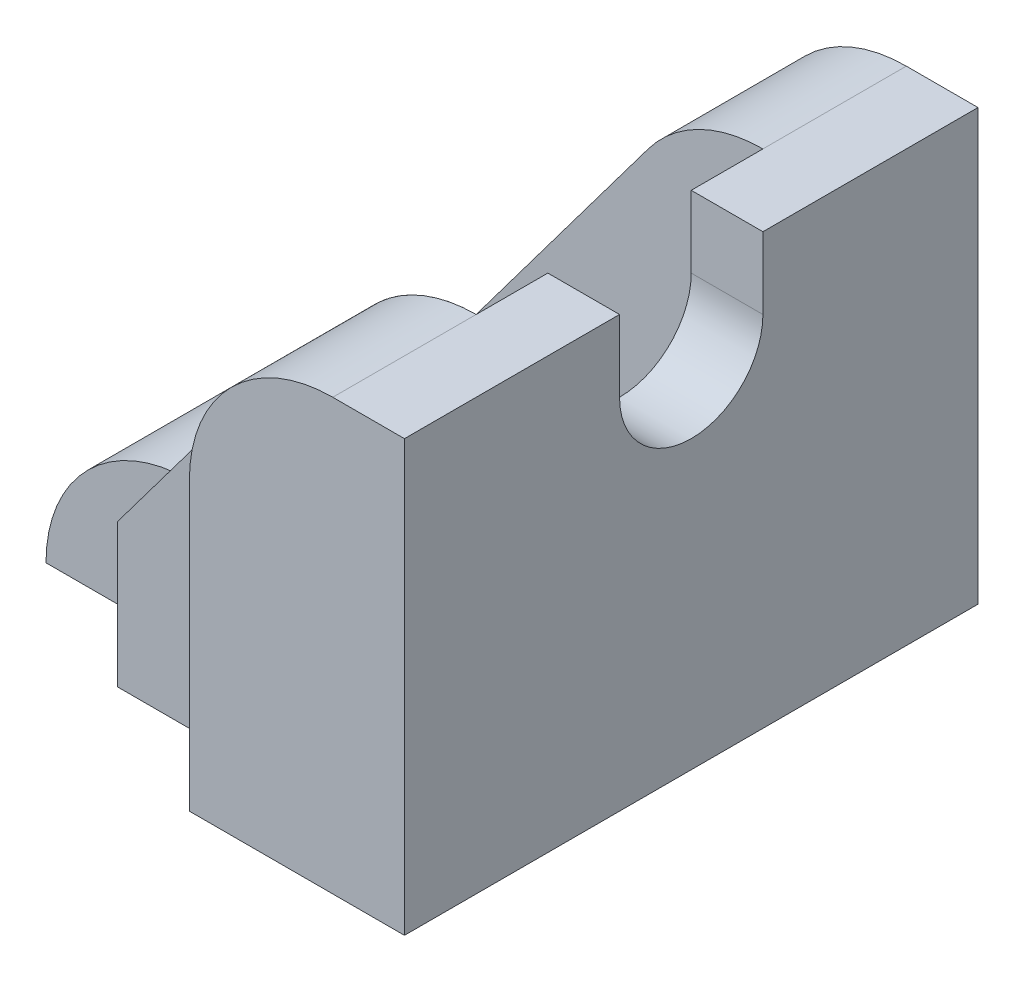
ISO-10303-21;
HEADER;
FILE_DESCRIPTION(('STEP AP214'),'2;1');
FILE_NAME('part.step','',(''),(''),'','','');
FILE_SCHEMA(('AUTOMOTIVE_DESIGN { 1 0 10303 214 1 1 1 1 }'));
ENDSEC;
DATA;
#1=APPLICATION_CONTEXT('core data for automotive mechanical design processes');
#2=APPLICATION_PROTOCOL_DEFINITION('international standard','automotive_design',2000,#1);
#3=PRODUCT_CONTEXT('',#1,'mechanical');
#4=PRODUCT('Part','Part','',(#3));
#5=PRODUCT_RELATED_PRODUCT_CATEGORY('part','',(#4));
#6=PRODUCT_DEFINITION_FORMATION('','',#4);
#7=PRODUCT_DEFINITION_CONTEXT('part definition',#1,'design');
#8=PRODUCT_DEFINITION('design','',#6,#7);
#9=PRODUCT_DEFINITION_SHAPE('','',#8);
#10=(LENGTH_UNIT() NAMED_UNIT(*) SI_UNIT(.MILLI.,.METRE.));
#11=(NAMED_UNIT(*) PLANE_ANGLE_UNIT() SI_UNIT($,.RADIAN.));
#12=(NAMED_UNIT(*) SI_UNIT($,.STERADIAN.) SOLID_ANGLE_UNIT());
#13=UNCERTAINTY_MEASURE_WITH_UNIT(LENGTH_MEASURE(1.E-05),#10,'distance_accuracy_value','');
#14=(GEOMETRIC_REPRESENTATION_CONTEXT(3) GLOBAL_UNCERTAINTY_ASSIGNED_CONTEXT((#13)) GLOBAL_UNIT_ASSIGNED_CONTEXT((#10,
#11,#12)) REPRESENTATION_CONTEXT('',''));
#15=CARTESIAN_POINT('',(0.,0.,0.));
#16=DIRECTION('',(0.,0.,1.));
#17=DIRECTION('',(1.,0.,0.));
#18=AXIS2_PLACEMENT_3D('',#15,#16,#17);
#19=CARTESIAN_POINT('',(-4.99999999999999,0.,2.));
#20=DIRECTION('',(0.,0.,1.));
#21=DIRECTION('',(1.,0.,0.));
#22=AXIS2_PLACEMENT_3D('',#19,#20,#21);
#23=CYLINDRICAL_SURFACE('',#22,2.00000000000001);
#24=DIRECTION('',(0.,0.,1.));
#25=VECTOR('',#24,1.);
#26=CARTESIAN_POINT('',(-7.,0.,2.));
#27=LINE('',#26,#25);
#28=CARTESIAN_POINT('',(-7.,0.,2.));
#29=VERTEX_POINT('',#28);
#30=CARTESIAN_POINT('',(-7.,0.,6.));
#31=VERTEX_POINT('',#30);
#32=EDGE_CURVE('E323',#29,#31,#27,.T.);
#33=ORIENTED_EDGE('',*,*,#32,.T.);
#34=CARTESIAN_POINT('',(-5.,0.,6.));
#35=DIRECTION('',(0.,0.,1.));
#36=DIRECTION('',(1.,0.,0.));
#37=AXIS2_PLACEMENT_3D('',#34,#35,#36);
#38=CIRCLE('',#37,2.);
#39=CARTESIAN_POINT('',(-5.,2.,6.));
#40=VERTEX_POINT('',#39);
#41=EDGE_CURVE('E386',#40,#31,#38,.T.);
#42=ORIENTED_EDGE('',*,*,#41,.F.);
#43=DIRECTION('',(0.,0.,1.));
#44=VECTOR('',#43,1.);
#45=CARTESIAN_POINT('',(-5.,2.,6.));
#46=LINE('',#45,#44);
#47=CARTESIAN_POINT('',(-5.,2.,4.));
#48=VERTEX_POINT('',#47);
#49=EDGE_CURVE('E337',#48,#40,#46,.T.);
#50=ORIENTED_EDGE('',*,*,#49,.F.);
#51=CARTESIAN_POINT('',(-5.,2.,2.));
#52=VERTEX_POINT('',#51);
#53=EDGE_CURVE('E465',#52,#48,#46,.T.);
#54=ORIENTED_EDGE('',*,*,#53,.F.);
#55=CARTESIAN_POINT('',(-4.99999999999999,0.,2.));
#56=DIRECTION('',(0.,0.,1.));
#57=DIRECTION('',(1.,0.,0.));
#58=AXIS2_PLACEMENT_3D('',#55,#56,#57);
#59=CIRCLE('',#58,2.00000000000001);
#60=EDGE_CURVE('E377',#52,#29,#59,.T.);
#61=ORIENTED_EDGE('',*,*,#60,.T.);
#62=EDGE_LOOP('',(#33,#42,#50,#54,#61));
#63=FACE_BOUND('',#62,.T.);
#64=ADVANCED_FACE('F32',(#63),#23,.T.);
#65=CARTESIAN_POINT('',(0.,6.,8.));
#66=DIRECTION('',(0.,-1.,0.));
#67=DIRECTION('',(0.,0.,-1.));
#68=AXIS2_PLACEMENT_3D('',#65,#66,#67);
#69=PLANE('',#68);
#70=DIRECTION('',(0.,0.,-1.));
#71=VECTOR('',#70,1.);
#72=CARTESIAN_POINT('',(0.,6.,8.));
#73=LINE('',#72,#71);
#74=CARTESIAN_POINT('',(0.,6.,8.));
#75=VERTEX_POINT('',#74);
#76=CARTESIAN_POINT('',(0.,6.,5.));
#77=VERTEX_POINT('',#76);
#78=EDGE_CURVE('E248',#75,#77,#73,.T.);
#79=ORIENTED_EDGE('',*,*,#78,.T.);
#80=DIRECTION('',(-1.,0.,0.));
#81=VECTOR('',#80,1.);
#82=CARTESIAN_POINT('',(0.,6.,5.));
#83=LINE('',#82,#81);
#84=CARTESIAN_POINT('',(-1.,6.,5.));
#85=VERTEX_POINT('',#84);
#86=EDGE_CURVE('E328',#77,#85,#83,.T.);
#87=ORIENTED_EDGE('',*,*,#86,.T.);
#88=DIRECTION('',(0.,0.,-1.));
#89=VECTOR('',#88,1.);
#90=CARTESIAN_POINT('',(-1.,6.,2.));
#91=LINE('',#90,#89);
#92=CARTESIAN_POINT('',(-1.,6.,6.));
#93=VERTEX_POINT('',#92);
#94=EDGE_CURVE('E338',#93,#85,#91,.T.);
#95=ORIENTED_EDGE('',*,*,#94,.F.);
#96=DIRECTION('',(0.,0.,-1.));
#97=VECTOR('',#96,1.);
#98=CARTESIAN_POINT('',(-1.,6.,8.));
#99=LINE('',#98,#97);
#100=CARTESIAN_POINT('',(-1.,6.,8.));
#101=VERTEX_POINT('',#100);
#102=EDGE_CURVE('E245',#101,#93,#99,.T.);
#103=ORIENTED_EDGE('',*,*,#102,.F.);
#104=DIRECTION('',(-1.,0.,0.));
#105=VECTOR('',#104,1.);
#106=CARTESIAN_POINT('',(0.,6.,8.));
#107=LINE('',#106,#105);
#108=EDGE_CURVE('E292',#75,#101,#107,.T.);
#109=ORIENTED_EDGE('',*,*,#108,.F.);
#110=EDGE_LOOP('',(#79,#87,#95,#103,#109));
#111=FACE_BOUND('',#110,.T.);
#112=ADVANCED_FACE('F366',(#111),#69,.F.);
#113=CARTESIAN_POINT('',(-1.,4.,8.));
#114=DIRECTION('',(0.,0.,-1.));
#115=DIRECTION('',(-1.,0.,0.));
#116=AXIS2_PLACEMENT_3D('',#113,#114,#115);
#117=CYLINDRICAL_SURFACE('',#116,2.);
#118=DIRECTION('',(0.,0.,-1.));
#119=VECTOR('',#118,1.);
#120=CARTESIAN_POINT('',(-2.6,5.2,8.));
#121=LINE('',#120,#119);
#122=CARTESIAN_POINT('',(-2.6,5.2,2.));
#123=VERTEX_POINT('',#122);
#124=CARTESIAN_POINT('',(-2.6,5.2,1.));
#125=VERTEX_POINT('',#124);
#126=EDGE_CURVE('E244',#123,#125,#121,.T.);
#127=ORIENTED_EDGE('',*,*,#126,.F.);
#128=CARTESIAN_POINT('',(-1.,4.,2.));
#129=DIRECTION('',(0.,0.,-1.));
#130=DIRECTION('',(-1.,0.,0.));
#131=AXIS2_PLACEMENT_3D('',#128,#129,#130);
#132=CIRCLE('',#131,2.);
#133=CARTESIAN_POINT('',(-1.,6.,2.));
#134=VERTEX_POINT('',#133);
#135=EDGE_CURVE('E281',#123,#134,#132,.T.);
#136=ORIENTED_EDGE('',*,*,#135,.T.);
#137=CARTESIAN_POINT('',(-1.,6.,0.));
#138=VERTEX_POINT('',#137);
#139=EDGE_CURVE('E243',#134,#138,#99,.T.);
#140=ORIENTED_EDGE('',*,*,#139,.T.);
#141=CARTESIAN_POINT('',(-1.,4.,0.));
#142=DIRECTION('',(0.,0.,1.));
#143=DIRECTION('',(1.,0.,0.));
#144=AXIS2_PLACEMENT_3D('',#141,#142,#143);
#145=CIRCLE('',#144,2.);
#146=CARTESIAN_POINT('',(-3.,4.,0.));
#147=VERTEX_POINT('',#146);
#148=EDGE_CURVE('E276',#138,#147,#145,.T.);
#149=ORIENTED_EDGE('',*,*,#148,.T.);
#150=DIRECTION('',(0.,0.,-1.));
#151=VECTOR('',#150,1.);
#152=CARTESIAN_POINT('',(-3.,4.,1.));
#153=LINE('',#152,#151);
#154=CARTESIAN_POINT('',(-3.,4.,1.));
#155=VERTEX_POINT('',#154);
#156=EDGE_CURVE('E433',#155,#147,#153,.T.);
#157=ORIENTED_EDGE('',*,*,#156,.F.);
#158=CARTESIAN_POINT('',(-1.,4.,1.));
#159=DIRECTION('',(0.,0.,1.));
#160=DIRECTION('',(1.,0.,0.));
#161=AXIS2_PLACEMENT_3D('',#158,#159,#160);
#162=CIRCLE('',#161,2.);
#163=EDGE_CURVE('E439',#125,#155,#162,.T.);
#164=ORIENTED_EDGE('',*,*,#163,.F.);
#165=EDGE_LOOP('',(#127,#136,#140,#149,#157,#164));
#166=FACE_BOUND('',#165,.T.);
#167=ADVANCED_FACE('F482',(#166),#117,.T.);
#168=CARTESIAN_POINT('',(-2.6,5.2,8.));
#169=DIRECTION('',(0.8,-0.6,0.));
#170=DIRECTION('',(0.6,0.8,0.));
#171=AXIS2_PLACEMENT_3D('',#168,#169,#170);
#172=PLANE('',#171);
#173=ORIENTED_EDGE('',*,*,#126,.T.);
#174=DIRECTION('',(0.6,0.8,0.));
#175=VECTOR('',#174,1.);
#176=CARTESIAN_POINT('',(-5.,2.,1.));
#177=LINE('',#176,#175);
#178=CARTESIAN_POINT('',(-5.,2.,1.));
#179=VERTEX_POINT('',#178);
#180=EDGE_CURVE('E220',#179,#125,#177,.T.);
#181=ORIENTED_EDGE('',*,*,#180,.F.);
#182=DIRECTION('',(0.,0.,-1.));
#183=VECTOR('',#182,1.);
#184=CARTESIAN_POINT('',(-5.,2.,8.));
#185=LINE('',#184,#183);
#186=EDGE_CURVE('E219',#52,#179,#185,.T.);
#187=ORIENTED_EDGE('',*,*,#186,.F.);
#188=DIRECTION('',(0.6,0.8,0.));
#189=VECTOR('',#188,1.);
#190=CARTESIAN_POINT('',(-2.6,5.2,2.));
#191=LINE('',#190,#189);
#192=EDGE_CURVE('E42',#52,#123,#191,.T.);
#193=ORIENTED_EDGE('',*,*,#192,.T.);
#194=EDGE_LOOP('',(#173,#181,#187,#193));
#195=FACE_BOUND('',#194,.T.);
#196=ADVANCED_FACE('F445',(#195),#172,.F.);
#197=CARTESIAN_POINT('',(0.,0.,8.));
#198=DIRECTION('',(-1.,0.,0.));
#199=DIRECTION('',(0.,0.,1.));
#200=AXIS2_PLACEMENT_3D('',#197,#198,#199);
#201=PLANE('',#200);
#202=CARTESIAN_POINT('',(0.,5.,4.));
#203=DIRECTION('',(-1.,0.,0.));
#204=DIRECTION('',(0.,0.,1.));
#205=AXIS2_PLACEMENT_3D('',#202,#203,#204);
#206=CIRCLE('',#205,1.);
#207=CARTESIAN_POINT('',(0.,5.,3.));
#208=VERTEX_POINT('',#207);
#209=CARTESIAN_POINT('',(0.,5.,5.));
#210=VERTEX_POINT('',#209);
#211=EDGE_CURVE('E310',#208,#210,#206,.T.);
#212=ORIENTED_EDGE('',*,*,#211,.T.);
#213=DIRECTION('',(0.,1.,0.));
#214=VECTOR('',#213,1.);
#215=CARTESIAN_POINT('',(0.,6.,5.));
#216=LINE('',#215,#214);
#217=EDGE_CURVE('E308',#210,#77,#216,.T.);
#218=ORIENTED_EDGE('',*,*,#217,.T.);
#219=ORIENTED_EDGE('',*,*,#78,.F.);
#220=DIRECTION('',(0.,1.,0.));
#221=VECTOR('',#220,1.);
#222=CARTESIAN_POINT('',(0.,0.,8.));
#223=LINE('',#222,#221);
#224=CARTESIAN_POINT('',(0.,0.,8.));
#225=VERTEX_POINT('',#224);
#226=EDGE_CURVE('E290',#225,#75,#223,.T.);
#227=ORIENTED_EDGE('',*,*,#226,.F.);
#228=DIRECTION('',(0.,0.,-1.));
#229=VECTOR('',#228,1.);
#230=CARTESIAN_POINT('',(0.,0.,8.));
#231=LINE('',#230,#229);
#232=CARTESIAN_POINT('',(0.,0.,0.));
#233=VERTEX_POINT('',#232);
#234=EDGE_CURVE('E226',#225,#233,#231,.T.);
#235=ORIENTED_EDGE('',*,*,#234,.T.);
#236=DIRECTION('',(0.,1.,0.));
#237=VECTOR('',#236,1.);
#238=CARTESIAN_POINT('',(0.,0.,0.));
#239=LINE('',#238,#237);
#240=CARTESIAN_POINT('',(0.,6.,0.));
#241=VERTEX_POINT('',#240);
#242=EDGE_CURVE('E274',#233,#241,#239,.T.);
#243=ORIENTED_EDGE('',*,*,#242,.T.);
#244=CARTESIAN_POINT('',(0.,6.,3.));
#245=VERTEX_POINT('',#244);
#246=EDGE_CURVE('E247',#245,#241,#73,.T.);
#247=ORIENTED_EDGE('',*,*,#246,.F.);
#248=DIRECTION('',(0.,-1.,0.));
#249=VECTOR('',#248,1.);
#250=CARTESIAN_POINT('',(0.,6.,3.));
#251=LINE('',#250,#249);
#252=EDGE_CURVE('E315',#245,#208,#251,.T.);
#253=ORIENTED_EDGE('',*,*,#252,.T.);
#254=EDGE_LOOP('',(#212,#218,#219,#227,#235,#243,#247,#253));
#255=FACE_BOUND('',#254,.T.);
#256=ADVANCED_FACE('F34',(#255),#201,.F.);
#257=CARTESIAN_POINT('',(-1.,6.,3.));
#258=VERTEX_POINT('',#257);
#259=EDGE_CURVE('E330',#258,#134,#91,.T.);
#260=ORIENTED_EDGE('',*,*,#259,.F.);
#261=DIRECTION('',(-1.,0.,0.));
#262=VECTOR('',#261,1.);
#263=CARTESIAN_POINT('',(0.,6.,3.));
#264=LINE('',#263,#262);
#265=EDGE_CURVE('E266',#245,#258,#264,.T.);
#266=ORIENTED_EDGE('',*,*,#265,.F.);
#267=ORIENTED_EDGE('',*,*,#246,.T.);
#268=DIRECTION('',(-1.,0.,0.));
#269=VECTOR('',#268,1.);
#270=CARTESIAN_POINT('',(0.,6.,0.));
#271=LINE('',#270,#269);
#272=EDGE_CURVE('E264',#241,#138,#271,.T.);
#273=ORIENTED_EDGE('',*,*,#272,.T.);
#274=ORIENTED_EDGE('',*,*,#139,.F.);
#275=EDGE_LOOP('',(#260,#266,#267,#273,#274));
#276=FACE_BOUND('',#275,.T.);
#277=ADVANCED_FACE('F262',(#276),#69,.F.);
#278=ORIENTED_EDGE('',*,*,#102,.T.);
#279=CARTESIAN_POINT('',(-1.,4.,6.));
#280=DIRECTION('',(0.,0.,1.));
#281=DIRECTION('',(1.,0.,0.));
#282=AXIS2_PLACEMENT_3D('',#279,#280,#281);
#283=CIRCLE('',#282,2.);
#284=CARTESIAN_POINT('',(-2.6,5.2,6.));
#285=VERTEX_POINT('',#284);
#286=EDGE_CURVE('E284',#93,#285,#283,.T.);
#287=ORIENTED_EDGE('',*,*,#286,.T.);
#288=CARTESIAN_POINT('',(-2.6,5.2,7.));
#289=VERTEX_POINT('',#288);
#290=EDGE_CURVE('E241',#289,#285,#121,.T.);
#291=ORIENTED_EDGE('',*,*,#290,.F.);
#292=CARTESIAN_POINT('',(-0.999999999999999,4.,7.));
#293=DIRECTION('',(0.,0.,-1.));
#294=DIRECTION('',(-1.,0.,0.));
#295=AXIS2_PLACEMENT_3D('',#292,#293,#294);
#296=CIRCLE('',#295,2.);
#297=CARTESIAN_POINT('',(-3.,4.,7.));
#298=VERTEX_POINT('',#297);
#299=EDGE_CURVE('E424',#298,#289,#296,.T.);
#300=ORIENTED_EDGE('',*,*,#299,.F.);
#301=DIRECTION('',(0.,0.,1.));
#302=VECTOR('',#301,1.);
#303=CARTESIAN_POINT('',(-3.,4.,7.));
#304=LINE('',#303,#302);
#305=CARTESIAN_POINT('',(-3.,4.,8.));
#306=VERTEX_POINT('',#305);
#307=EDGE_CURVE('E416',#298,#306,#304,.T.);
#308=ORIENTED_EDGE('',*,*,#307,.T.);
#309=CARTESIAN_POINT('',(-1.,4.,8.));
#310=DIRECTION('',(0.,0.,1.));
#311=DIRECTION('',(1.,0.,0.));
#312=AXIS2_PLACEMENT_3D('',#309,#310,#311);
#313=CIRCLE('',#312,2.);
#314=EDGE_CURVE('E295',#101,#306,#313,.T.);
#315=ORIENTED_EDGE('',*,*,#314,.F.);
#316=EDGE_LOOP('',(#278,#287,#291,#300,#308,#315));
#317=FACE_BOUND('',#316,.T.);
#318=ADVANCED_FACE('F353',(#317),#117,.T.);
#319=CARTESIAN_POINT('',(-5.,2.,7.));
#320=VERTEX_POINT('',#319);
#321=EDGE_CURVE('E36',#320,#40,#185,.T.);
#322=ORIENTED_EDGE('',*,*,#321,.F.);
#323=DIRECTION('',(-0.6,-0.8,0.));
#324=VECTOR('',#323,1.);
#325=CARTESIAN_POINT('',(-5.,2.,7.));
#326=LINE('',#325,#324);
#327=EDGE_CURVE('E49',#289,#320,#326,.T.);
#328=ORIENTED_EDGE('',*,*,#327,.F.);
#329=ORIENTED_EDGE('',*,*,#290,.T.);
#330=DIRECTION('',(-0.6,-0.8,0.));
#331=VECTOR('',#330,1.);
#332=CARTESIAN_POINT('',(-2.6,5.2,6.));
#333=LINE('',#332,#331);
#334=EDGE_CURVE('E250',#285,#40,#333,.T.);
#335=ORIENTED_EDGE('',*,*,#334,.T.);
#336=EDGE_LOOP('',(#322,#328,#329,#335));
#337=FACE_BOUND('',#336,.T.);
#338=ADVANCED_FACE('F473',(#337),#172,.F.);
#339=CARTESIAN_POINT('',(-5.,0.,8.));
#340=DIRECTION('',(1.,0.,0.));
#341=DIRECTION('',(0.,0.,-1.));
#342=AXIS2_PLACEMENT_3D('',#339,#340,#341);
#343=PLANE('',#342);
#344=ORIENTED_EDGE('',*,*,#186,.T.);
#345=DIRECTION('',(0.,1.,0.));
#346=VECTOR('',#345,1.);
#347=CARTESIAN_POINT('',(-5.,0.,1.));
#348=LINE('',#347,#346);
#349=CARTESIAN_POINT('',(-5.,0.,1.));
#350=VERTEX_POINT('',#349);
#351=EDGE_CURVE('E202',#350,#179,#348,.T.);
#352=ORIENTED_EDGE('',*,*,#351,.F.);
#353=DIRECTION('',(0.,0.,-1.));
#354=VECTOR('',#353,1.);
#355=CARTESIAN_POINT('',(-5.,0.,8.));
#356=LINE('',#355,#354);
#357=CARTESIAN_POINT('',(-5.,0.,2.));
#358=VERTEX_POINT('',#357);
#359=EDGE_CURVE('E217',#358,#350,#356,.T.);
#360=ORIENTED_EDGE('',*,*,#359,.F.);
#361=DIRECTION('',(0.,1.,0.));
#362=VECTOR('',#361,1.);
#363=CARTESIAN_POINT('',(-5.,2.,2.));
#364=LINE('',#363,#362);
#365=EDGE_CURVE('E235',#358,#52,#364,.T.);
#366=ORIENTED_EDGE('',*,*,#365,.T.);
#367=EDGE_LOOP('',(#344,#352,#360,#366));
#368=FACE_BOUND('',#367,.T.);
#369=ADVANCED_FACE('F215',(#368),#343,.F.);
#370=CARTESIAN_POINT('',(0.,0.,8.));
#371=DIRECTION('',(0.,1.,0.));
#372=DIRECTION('',(0.,0.,1.));
#373=AXIS2_PLACEMENT_3D('',#370,#371,#372);
#374=PLANE('',#373);
#375=DIRECTION('',(-1.,0.,0.));
#376=VECTOR('',#375,1.);
#377=CARTESIAN_POINT('',(0.,0.,3.));
#378=LINE('',#377,#376);
#379=CARTESIAN_POINT('',(-3.,0.,3.));
#380=VERTEX_POINT('',#379);
#381=CARTESIAN_POINT('',(-4.,0.,3.));
#382=VERTEX_POINT('',#381);
#383=EDGE_CURVE('E390',#380,#382,#378,.T.);
#384=ORIENTED_EDGE('',*,*,#383,.T.);
#385=CARTESIAN_POINT('',(-4.,0.,4.));
#386=DIRECTION('',(0.,1.,0.));
#387=DIRECTION('',(0.,0.,1.));
#388=AXIS2_PLACEMENT_3D('',#385,#386,#387);
#389=CIRCLE('',#388,1.);
#390=CARTESIAN_POINT('',(-4.,0.,5.));
#391=VERTEX_POINT('',#390);
#392=EDGE_CURVE('E387',#382,#391,#389,.T.);
#393=ORIENTED_EDGE('',*,*,#392,.T.);
#394=DIRECTION('',(1.,0.,0.));
#395=VECTOR('',#394,1.);
#396=CARTESIAN_POINT('',(0.,0.,5.));
#397=LINE('',#396,#395);
#398=CARTESIAN_POINT('',(-3.,0.,5.));
#399=VERTEX_POINT('',#398);
#400=EDGE_CURVE('E396',#391,#399,#397,.T.);
#401=ORIENTED_EDGE('',*,*,#400,.T.);
#402=CARTESIAN_POINT('',(-3.,0.,4.));
#403=DIRECTION('',(0.,1.,0.));
#404=DIRECTION('',(0.,0.,1.));
#405=AXIS2_PLACEMENT_3D('',#402,#403,#404);
#406=CIRCLE('',#405,1.);
#407=EDGE_CURVE('E393',#399,#380,#406,.T.);
#408=ORIENTED_EDGE('',*,*,#407,.T.);
#409=EDGE_LOOP('',(#384,#393,#401,#408));
#410=FACE_BOUND('',#409,.T.);
#411=DIRECTION('',(-1.,0.,0.));
#412=VECTOR('',#411,1.);
#413=CARTESIAN_POINT('',(-5.,0.,1.));
#414=LINE('',#413,#412);
#415=CARTESIAN_POINT('',(-3.,0.,1.));
#416=VERTEX_POINT('',#415);
#417=EDGE_CURVE('E198',#416,#350,#414,.T.);
#418=ORIENTED_EDGE('',*,*,#417,.F.);
#419=DIRECTION('',(0.,0.,-1.));
#420=VECTOR('',#419,1.);
#421=CARTESIAN_POINT('',(-3.,0.,1.));
#422=LINE('',#421,#420);
#423=CARTESIAN_POINT('',(-3.,0.,0.));
#424=VERTEX_POINT('',#423);
#425=EDGE_CURVE('E422',#416,#424,#422,.T.);
#426=ORIENTED_EDGE('',*,*,#425,.T.);
#427=DIRECTION('',(1.,0.,0.));
#428=VECTOR('',#427,1.);
#429=CARTESIAN_POINT('',(0.,0.,0.));
#430=LINE('',#429,#428);
#431=EDGE_CURVE('E289',#424,#233,#430,.T.);
#432=ORIENTED_EDGE('',*,*,#431,.T.);
#433=ORIENTED_EDGE('',*,*,#234,.F.);
#434=DIRECTION('',(1.,0.,0.));
#435=VECTOR('',#434,1.);
#436=CARTESIAN_POINT('',(-3.,0.,8.));
#437=LINE('',#436,#435);
#438=CARTESIAN_POINT('',(-3.,0.,8.));
#439=VERTEX_POINT('',#438);
#440=EDGE_CURVE('E229',#439,#225,#437,.T.);
#441=ORIENTED_EDGE('',*,*,#440,.F.);
#442=DIRECTION('',(0.,0.,1.));
#443=VECTOR('',#442,1.);
#444=CARTESIAN_POINT('',(-3.,0.,7.));
#445=LINE('',#444,#443);
#446=CARTESIAN_POINT('',(-3.,0.,7.));
#447=VERTEX_POINT('',#446);
#448=EDGE_CURVE('E417',#447,#439,#445,.T.);
#449=ORIENTED_EDGE('',*,*,#448,.F.);
#450=DIRECTION('',(1.,0.,0.));
#451=VECTOR('',#450,1.);
#452=CARTESIAN_POINT('',(-5.,0.,7.));
#453=LINE('',#452,#451);
#454=CARTESIAN_POINT('',(-5.,0.,7.));
#455=VERTEX_POINT('',#454);
#456=EDGE_CURVE('E429',#455,#447,#453,.T.);
#457=ORIENTED_EDGE('',*,*,#456,.F.);
#458=DIRECTION('',(0.,0.,1.));
#459=VECTOR('',#458,1.);
#460=CARTESIAN_POINT('',(-5.,0.,6.));
#461=LINE('',#460,#459);
#462=CARTESIAN_POINT('',(-5.,0.,6.));
#463=VERTEX_POINT('',#462);
#464=EDGE_CURVE('E380',#463,#455,#461,.T.);
#465=ORIENTED_EDGE('',*,*,#464,.F.);
#466=DIRECTION('',(1.,0.,0.));
#467=VECTOR('',#466,1.);
#468=CARTESIAN_POINT('',(-5.,0.,6.));
#469=LINE('',#468,#467);
#470=EDGE_CURVE('E384',#31,#463,#469,.T.);
#471=ORIENTED_EDGE('',*,*,#470,.F.);
#472=ORIENTED_EDGE('',*,*,#32,.F.);
#473=DIRECTION('',(1.,0.,0.));
#474=VECTOR('',#473,1.);
#475=CARTESIAN_POINT('',(-5.,0.,2.));
#476=LINE('',#475,#474);
#477=EDGE_CURVE('E225',#29,#358,#476,.T.);
#478=ORIENTED_EDGE('',*,*,#477,.T.);
#479=ORIENTED_EDGE('',*,*,#359,.T.);
#480=EDGE_LOOP('',(#418,#426,#432,#433,#441,#449,#457,#465,#471,#472,#478,#479));
#481=FACE_BOUND('',#480,.T.);
#482=ADVANCED_FACE('F223',(#410,#481),#374,.F.);
#483=CARTESIAN_POINT('',(-1.,4.,8.));
#484=DIRECTION('',(0.,0.,1.));
#485=DIRECTION('',(1.,0.,0.));
#486=AXIS2_PLACEMENT_3D('',#483,#484,#485);
#487=PLANE('',#486);
#488=ORIENTED_EDGE('',*,*,#314,.T.);
#489=DIRECTION('',(0.,1.,0.));
#490=VECTOR('',#489,1.);
#491=CARTESIAN_POINT('',(-3.,0.,8.));
#492=LINE('',#491,#490);
#493=EDGE_CURVE('E304',#439,#306,#492,.T.);
#494=ORIENTED_EDGE('',*,*,#493,.F.);
#495=ORIENTED_EDGE('',*,*,#440,.T.);
#496=ORIENTED_EDGE('',*,*,#226,.T.);
#497=ORIENTED_EDGE('',*,*,#108,.T.);
#498=EDGE_LOOP('',(#488,#494,#495,#496,#497));
#499=FACE_BOUND('',#498,.T.);
#500=ADVANCED_FACE('F302',(#499),#487,.T.);
#501=CARTESIAN_POINT('',(-1.,4.,0.));
#502=DIRECTION('',(0.,0.,1.));
#503=DIRECTION('',(1.,0.,0.));
#504=AXIS2_PLACEMENT_3D('',#501,#502,#503);
#505=PLANE('',#504);
#506=ORIENTED_EDGE('',*,*,#431,.F.);
#507=DIRECTION('',(0.,-1.,0.));
#508=VECTOR('',#507,1.);
#509=CARTESIAN_POINT('',(-3.,0.,0.));
#510=LINE('',#509,#508);
#511=EDGE_CURVE('E210',#147,#424,#510,.T.);
#512=ORIENTED_EDGE('',*,*,#511,.F.);
#513=ORIENTED_EDGE('',*,*,#148,.F.);
#514=ORIENTED_EDGE('',*,*,#272,.F.);
#515=ORIENTED_EDGE('',*,*,#242,.F.);
#516=EDGE_LOOP('',(#506,#512,#513,#514,#515));
#517=FACE_BOUND('',#516,.T.);
#518=ADVANCED_FACE('F273',(#517),#505,.F.);
#519=CARTESIAN_POINT('',(-5.,2.,2.));
#520=DIRECTION('',(0.,0.,-1.));
#521=DIRECTION('',(-1.,0.,0.));
#522=AXIS2_PLACEMENT_3D('',#519,#520,#521);
#523=PLANE('',#522);
#524=ORIENTED_EDGE('',*,*,#192,.F.);
#525=DIRECTION('',(-1.,0.,0.));
#526=VECTOR('',#525,1.);
#527=CARTESIAN_POINT('',(-5.,2.,2.));
#528=LINE('',#527,#526);
#529=CARTESIAN_POINT('',(-1.,2.,2.));
#530=VERTEX_POINT('',#529);
#531=EDGE_CURVE('E334',#530,#52,#528,.T.);
#532=ORIENTED_EDGE('',*,*,#531,.F.);
#533=DIRECTION('',(0.,1.,0.));
#534=VECTOR('',#533,1.);
#535=CARTESIAN_POINT('',(-1.,2.,2.));
#536=LINE('',#535,#534);
#537=EDGE_CURVE('E346',#530,#134,#536,.T.);
#538=ORIENTED_EDGE('',*,*,#537,.T.);
#539=ORIENTED_EDGE('',*,*,#135,.F.);
#540=EDGE_LOOP('',(#524,#532,#538,#539));
#541=FACE_BOUND('',#540,.T.);
#542=ADVANCED_FACE('F505',(#541),#523,.F.);
#543=CARTESIAN_POINT('',(-1.,2.,6.));
#544=DIRECTION('',(0.,0.,1.));
#545=DIRECTION('',(1.,0.,0.));
#546=AXIS2_PLACEMENT_3D('',#543,#544,#545);
#547=PLANE('',#546);
#548=DIRECTION('',(0.,1.,0.));
#549=VECTOR('',#548,1.);
#550=CARTESIAN_POINT('',(-1.,2.,6.));
#551=LINE('',#550,#549);
#552=CARTESIAN_POINT('',(-1.,2.,6.));
#553=VERTEX_POINT('',#552);
#554=EDGE_CURVE('E342',#553,#93,#551,.T.);
#555=ORIENTED_EDGE('',*,*,#554,.F.);
#556=DIRECTION('',(1.,0.,0.));
#557=VECTOR('',#556,1.);
#558=CARTESIAN_POINT('',(-1.,2.,6.));
#559=LINE('',#558,#557);
#560=EDGE_CURVE('E343',#40,#553,#559,.T.);
#561=ORIENTED_EDGE('',*,*,#560,.F.);
#562=ORIENTED_EDGE('',*,*,#334,.F.);
#563=ORIENTED_EDGE('',*,*,#286,.F.);
#564=EDGE_LOOP('',(#555,#561,#562,#563));
#565=FACE_BOUND('',#564,.T.);
#566=ADVANCED_FACE('F358',(#565),#547,.F.);
#567=CARTESIAN_POINT('',(-1.,2.,2.));
#568=DIRECTION('',(1.,0.,0.));
#569=DIRECTION('',(0.,0.,-1.));
#570=AXIS2_PLACEMENT_3D('',#567,#568,#569);
#571=PLANE('',#570);
#572=ORIENTED_EDGE('',*,*,#94,.T.);
#573=DIRECTION('',(0.,1.,0.));
#574=VECTOR('',#573,1.);
#575=CARTESIAN_POINT('',(-1.,6.,5.));
#576=LINE('',#575,#574);
#577=CARTESIAN_POINT('',(-1.,5.,5.));
#578=VERTEX_POINT('',#577);
#579=EDGE_CURVE('E326',#578,#85,#576,.T.);
#580=ORIENTED_EDGE('',*,*,#579,.F.);
#581=CARTESIAN_POINT('',(-1.,5.,4.));
#582=DIRECTION('',(-1.,0.,0.));
#583=DIRECTION('',(0.,0.,1.));
#584=AXIS2_PLACEMENT_3D('',#581,#582,#583);
#585=CIRCLE('',#584,1.);
#586=CARTESIAN_POINT('',(-1.,5.,3.));
#587=VERTEX_POINT('',#586);
#588=EDGE_CURVE('E322',#587,#578,#585,.T.);
#589=ORIENTED_EDGE('',*,*,#588,.F.);
#590=DIRECTION('',(0.,-1.,0.));
#591=VECTOR('',#590,1.);
#592=CARTESIAN_POINT('',(-1.,6.,3.));
#593=LINE('',#592,#591);
#594=EDGE_CURVE('E319',#258,#587,#593,.T.);
#595=ORIENTED_EDGE('',*,*,#594,.F.);
#596=ORIENTED_EDGE('',*,*,#259,.T.);
#597=ORIENTED_EDGE('',*,*,#537,.F.);
#598=DIRECTION('',(0.,0.,-1.));
#599=VECTOR('',#598,1.);
#600=CARTESIAN_POINT('',(-1.,2.,2.));
#601=LINE('',#600,#599);
#602=EDGE_CURVE('E339',#553,#530,#601,.T.);
#603=ORIENTED_EDGE('',*,*,#602,.F.);
#604=ORIENTED_EDGE('',*,*,#554,.T.);
#605=EDGE_LOOP('',(#572,#580,#589,#595,#596,#597,#603,#604));
#606=FACE_BOUND('',#605,.T.);
#607=ADVANCED_FACE('F364',(#606),#571,.F.);
#608=CARTESIAN_POINT('',(0.,2.,0.));
#609=DIRECTION('',(0.,-1.,0.));
#610=DIRECTION('',(0.,0.,-1.));
#611=AXIS2_PLACEMENT_3D('',#608,#609,#610);
#612=PLANE('',#611);
#613=DIRECTION('',(1.,0.,0.));
#614=VECTOR('',#613,1.);
#615=CARTESIAN_POINT('',(-4.,2.,5.));
#616=LINE('',#615,#614);
#617=CARTESIAN_POINT('',(-4.,2.,5.));
#618=VERTEX_POINT('',#617);
#619=CARTESIAN_POINT('',(-3.,2.,5.));
#620=VERTEX_POINT('',#619);
#621=EDGE_CURVE('E412',#618,#620,#616,.T.);
#622=ORIENTED_EDGE('',*,*,#621,.F.);
#623=CARTESIAN_POINT('',(-4.,2.,4.));
#624=DIRECTION('',(0.,-1.,0.));
#625=DIRECTION('',(0.,0.,-1.));
#626=AXIS2_PLACEMENT_3D('',#623,#624,#625);
#627=CIRCLE('',#626,1.);
#628=EDGE_CURVE('E11',#618,#48,#627,.T.);
#629=ORIENTED_EDGE('',*,*,#628,.T.);
#630=ORIENTED_EDGE('',*,*,#49,.T.);
#631=ORIENTED_EDGE('',*,*,#560,.T.);
#632=ORIENTED_EDGE('',*,*,#602,.T.);
#633=ORIENTED_EDGE('',*,*,#531,.T.);
#634=ORIENTED_EDGE('',*,*,#53,.T.);
#635=CARTESIAN_POINT('',(-4.,2.,4.));
#636=DIRECTION('',(0.,1.,0.));
#637=DIRECTION('',(0.,0.,1.));
#638=AXIS2_PLACEMENT_3D('',#635,#636,#637);
#639=CIRCLE('',#638,1.);
#640=CARTESIAN_POINT('',(-4.,2.,3.));
#641=VERTEX_POINT('',#640);
#642=EDGE_CURVE('E414',#641,#48,#639,.T.);
#643=ORIENTED_EDGE('',*,*,#642,.F.);
#644=DIRECTION('',(-1.,0.,0.));
#645=VECTOR('',#644,1.);
#646=CARTESIAN_POINT('',(-4.,2.,3.));
#647=LINE('',#646,#645);
#648=CARTESIAN_POINT('',(-3.,2.,3.));
#649=VERTEX_POINT('',#648);
#650=EDGE_CURVE('E402',#649,#641,#647,.T.);
#651=ORIENTED_EDGE('',*,*,#650,.F.);
#652=CARTESIAN_POINT('',(-3.,2.,4.));
#653=DIRECTION('',(0.,1.,0.));
#654=DIRECTION('',(0.,0.,1.));
#655=AXIS2_PLACEMENT_3D('',#652,#653,#654);
#656=CIRCLE('',#655,1.);
#657=EDGE_CURVE('E409',#620,#649,#656,.T.);
#658=ORIENTED_EDGE('',*,*,#657,.F.);
#659=EDGE_LOOP('',(#622,#629,#630,#631,#632,#633,#634,#643,#651,#658));
#660=FACE_BOUND('',#659,.T.);
#661=ADVANCED_FACE('F459',(#660),#612,.F.);
#662=CARTESIAN_POINT('',(0.,6.,5.));
#663=DIRECTION('',(0.,0.,1.));
#664=DIRECTION('',(1.,0.,0.));
#665=AXIS2_PLACEMENT_3D('',#662,#663,#664);
#666=PLANE('',#665);
#667=ORIENTED_EDGE('',*,*,#579,.T.);
#668=ORIENTED_EDGE('',*,*,#86,.F.);
#669=ORIENTED_EDGE('',*,*,#217,.F.);
#670=DIRECTION('',(-1.,0.,0.));
#671=VECTOR('',#670,1.);
#672=CARTESIAN_POINT('',(0.,5.,5.));
#673=LINE('',#672,#671);
#674=EDGE_CURVE('E331',#210,#578,#673,.T.);
#675=ORIENTED_EDGE('',*,*,#674,.T.);
#676=EDGE_LOOP('',(#667,#668,#669,#675));
#677=FACE_BOUND('',#676,.T.);
#678=ADVANCED_FACE('F367',(#677),#666,.F.);
#679=CARTESIAN_POINT('',(0.,5.,4.));
#680=DIRECTION('',(-1.,0.,0.));
#681=DIRECTION('',(0.,0.,1.));
#682=AXIS2_PLACEMENT_3D('',#679,#680,#681);
#683=CYLINDRICAL_SURFACE('',#682,1.);
#684=ORIENTED_EDGE('',*,*,#588,.T.);
#685=ORIENTED_EDGE('',*,*,#674,.F.);
#686=ORIENTED_EDGE('',*,*,#211,.F.);
#687=DIRECTION('',(-1.,0.,0.));
#688=VECTOR('',#687,1.);
#689=CARTESIAN_POINT('',(0.,5.,3.));
#690=LINE('',#689,#688);
#691=EDGE_CURVE('E313',#208,#587,#690,.T.);
#692=ORIENTED_EDGE('',*,*,#691,.T.);
#693=EDGE_LOOP('',(#684,#685,#686,#692));
#694=FACE_BOUND('',#693,.T.);
#695=ADVANCED_FACE('F371',(#694),#683,.F.);
#696=CARTESIAN_POINT('',(0.,6.,3.));
#697=DIRECTION('',(0.,0.,-1.));
#698=DIRECTION('',(-1.,0.,0.));
#699=AXIS2_PLACEMENT_3D('',#696,#697,#698);
#700=PLANE('',#699);
#701=ORIENTED_EDGE('',*,*,#594,.T.);
#702=ORIENTED_EDGE('',*,*,#691,.F.);
#703=ORIENTED_EDGE('',*,*,#252,.F.);
#704=ORIENTED_EDGE('',*,*,#265,.T.);
#705=EDGE_LOOP('',(#701,#702,#703,#704));
#706=FACE_BOUND('',#705,.T.);
#707=ADVANCED_FACE('F373',(#706),#700,.F.);
#708=CARTESIAN_POINT('',(-4.99999999999999,0.,2.));
#709=DIRECTION('',(0.,0.,1.));
#710=DIRECTION('',(1.,0.,0.));
#711=AXIS2_PLACEMENT_3D('',#708,#709,#710);
#712=PLANE('',#711);
#713=ORIENTED_EDGE('',*,*,#365,.F.);
#714=ORIENTED_EDGE('',*,*,#477,.F.);
#715=ORIENTED_EDGE('',*,*,#60,.F.);
#716=EDGE_LOOP('',(#713,#714,#715));
#717=FACE_BOUND('',#716,.T.);
#718=ADVANCED_FACE('F491',(#717),#712,.F.);
#719=CARTESIAN_POINT('',(-5.,2.,6.));
#720=DIRECTION('',(1.,0.,0.));
#721=DIRECTION('',(0.,1.,0.));
#722=AXIS2_PLACEMENT_3D('',#719,#720,#721);
#723=PLANE('',#722);
#724=ORIENTED_EDGE('',*,*,#464,.T.);
#725=DIRECTION('',(0.,-1.,0.));
#726=VECTOR('',#725,1.);
#727=CARTESIAN_POINT('',(-5.,2.,7.));
#728=LINE('',#727,#726);
#729=EDGE_CURVE('E421',#320,#455,#728,.T.);
#730=ORIENTED_EDGE('',*,*,#729,.F.);
#731=ORIENTED_EDGE('',*,*,#321,.T.);
#732=DIRECTION('',(0.,1.,0.));
#733=VECTOR('',#732,1.);
#734=CARTESIAN_POINT('',(-5.,2.,6.));
#735=LINE('',#734,#733);
#736=EDGE_CURVE('E383',#463,#40,#735,.T.);
#737=ORIENTED_EDGE('',*,*,#736,.F.);
#738=EDGE_LOOP('',(#724,#730,#731,#737));
#739=FACE_BOUND('',#738,.T.);
#740=ADVANCED_FACE('F452',(#739),#723,.F.);
#741=CARTESIAN_POINT('',(-5.,0.,6.));
#742=DIRECTION('',(0.,0.,1.));
#743=DIRECTION('',(1.,0.,0.));
#744=AXIS2_PLACEMENT_3D('',#741,#742,#743);
#745=PLANE('',#744);
#746=ORIENTED_EDGE('',*,*,#41,.T.);
#747=ORIENTED_EDGE('',*,*,#470,.T.);
#748=ORIENTED_EDGE('',*,*,#736,.T.);
#749=EDGE_LOOP('',(#746,#747,#748));
#750=FACE_BOUND('',#749,.T.);
#751=ADVANCED_FACE('F468',(#750),#745,.T.);
#752=CARTESIAN_POINT('',(-4.,-5.00000000001367E-05,4.));
#753=DIRECTION('',(0.,1.,0.));
#754=DIRECTION('',(0.,0.,1.));
#755=AXIS2_PLACEMENT_3D('',#752,#753,#754);
#756=CYLINDRICAL_SURFACE('',#755,1.);
#757=DIRECTION('',(0.,1.,0.));
#758=VECTOR('',#757,1.);
#759=CARTESIAN_POINT('',(-4.,-5.00000000001367E-05,3.));
#760=LINE('',#759,#758);
#761=EDGE_CURVE('E399',#382,#641,#760,.T.);
#762=ORIENTED_EDGE('',*,*,#761,.T.);
#763=ORIENTED_EDGE('',*,*,#642,.T.);
#764=ORIENTED_EDGE('',*,*,#628,.F.);
#765=DIRECTION('',(0.,1.,0.));
#766=VECTOR('',#765,1.);
#767=CARTESIAN_POINT('',(-4.,-5.00000000001367E-05,5.));
#768=LINE('',#767,#766);
#769=EDGE_CURVE('E400',#391,#618,#768,.T.);
#770=ORIENTED_EDGE('',*,*,#769,.F.);
#771=ORIENTED_EDGE('',*,*,#392,.F.);
#772=EDGE_LOOP('',(#762,#763,#764,#770,#771));
#773=FACE_BOUND('',#772,.T.);
#774=ADVANCED_FACE('F527',(#773),#756,.F.);
#775=CARTESIAN_POINT('',(-4.,-5.00000000001367E-05,3.));
#776=DIRECTION('',(0.,0.,-1.));
#777=DIRECTION('',(-1.,0.,0.));
#778=AXIS2_PLACEMENT_3D('',#775,#776,#777);
#779=PLANE('',#778);
#780=DIRECTION('',(0.,1.,0.));
#781=VECTOR('',#780,1.);
#782=CARTESIAN_POINT('',(-3.,-5.00000000001367E-05,3.));
#783=LINE('',#782,#781);
#784=EDGE_CURVE('E404',#380,#649,#783,.T.);
#785=ORIENTED_EDGE('',*,*,#784,.T.);
#786=ORIENTED_EDGE('',*,*,#650,.T.);
#787=ORIENTED_EDGE('',*,*,#761,.F.);
#788=ORIENTED_EDGE('',*,*,#383,.F.);
#789=EDGE_LOOP('',(#785,#786,#787,#788));
#790=FACE_BOUND('',#789,.T.);
#791=ADVANCED_FACE('F520',(#790),#779,.F.);
#792=CARTESIAN_POINT('',(-3.,-5.00000000001367E-05,4.));
#793=DIRECTION('',(0.,1.,0.));
#794=DIRECTION('',(0.,0.,1.));
#795=AXIS2_PLACEMENT_3D('',#792,#793,#794);
#796=CYLINDRICAL_SURFACE('',#795,1.);
#797=DIRECTION('',(0.,1.,0.));
#798=VECTOR('',#797,1.);
#799=CARTESIAN_POINT('',(-3.,-5.00000000001367E-05,5.));
#800=LINE('',#799,#798);
#801=EDGE_CURVE('E57',#399,#620,#800,.T.);
#802=ORIENTED_EDGE('',*,*,#801,.T.);
#803=ORIENTED_EDGE('',*,*,#657,.T.);
#804=ORIENTED_EDGE('',*,*,#784,.F.);
#805=ORIENTED_EDGE('',*,*,#407,.F.);
#806=EDGE_LOOP('',(#802,#803,#804,#805));
#807=FACE_BOUND('',#806,.T.);
#808=ADVANCED_FACE('F522',(#807),#796,.F.);
#809=CARTESIAN_POINT('',(-4.,-5.00000000001367E-05,5.));
#810=DIRECTION('',(0.,0.,1.));
#811=DIRECTION('',(1.,0.,0.));
#812=AXIS2_PLACEMENT_3D('',#809,#810,#811);
#813=PLANE('',#812);
#814=ORIENTED_EDGE('',*,*,#769,.T.);
#815=ORIENTED_EDGE('',*,*,#621,.T.);
#816=ORIENTED_EDGE('',*,*,#801,.F.);
#817=ORIENTED_EDGE('',*,*,#400,.F.);
#818=EDGE_LOOP('',(#814,#815,#816,#817));
#819=FACE_BOUND('',#818,.T.);
#820=ADVANCED_FACE('F529',(#819),#813,.F.);
#821=CARTESIAN_POINT('',(-3.,0.,7.));
#822=DIRECTION('',(1.,0.,0.));
#823=DIRECTION('',(0.,0.,-1.));
#824=AXIS2_PLACEMENT_3D('',#821,#822,#823);
#825=PLANE('',#824);
#826=ORIENTED_EDGE('',*,*,#493,.T.);
#827=ORIENTED_EDGE('',*,*,#307,.F.);
#828=DIRECTION('',(0.,1.,0.));
#829=VECTOR('',#828,1.);
#830=CARTESIAN_POINT('',(-3.,0.,7.));
#831=LINE('',#830,#829);
#832=EDGE_CURVE('E426',#447,#298,#831,.T.);
#833=ORIENTED_EDGE('',*,*,#832,.F.);
#834=ORIENTED_EDGE('',*,*,#448,.T.);
#835=EDGE_LOOP('',(#826,#827,#833,#834));
#836=FACE_BOUND('',#835,.T.);
#837=ADVANCED_FACE('F531',(#836),#825,.F.);
#838=CARTESIAN_POINT('',(-0.999999999999999,4.,7.));
#839=DIRECTION('',(0.,0.,-1.));
#840=DIRECTION('',(-1.,0.,0.));
#841=AXIS2_PLACEMENT_3D('',#838,#839,#840);
#842=PLANE('',#841);
#843=ORIENTED_EDGE('',*,*,#729,.T.);
#844=ORIENTED_EDGE('',*,*,#456,.T.);
#845=ORIENTED_EDGE('',*,*,#832,.T.);
#846=ORIENTED_EDGE('',*,*,#299,.T.);
#847=ORIENTED_EDGE('',*,*,#327,.T.);
#848=EDGE_LOOP('',(#843,#844,#845,#846,#847));
#849=FACE_BOUND('',#848,.T.);
#850=ADVANCED_FACE('F537',(#849),#842,.F.);
#851=CARTESIAN_POINT('',(-3.,0.,1.));
#852=DIRECTION('',(1.,0.,0.));
#853=DIRECTION('',(0.,0.,-1.));
#854=AXIS2_PLACEMENT_3D('',#851,#852,#853);
#855=PLANE('',#854);
#856=ORIENTED_EDGE('',*,*,#511,.T.);
#857=ORIENTED_EDGE('',*,*,#425,.F.);
#858=DIRECTION('',(0.,-1.,0.));
#859=VECTOR('',#858,1.);
#860=CARTESIAN_POINT('',(-3.,0.,1.));
#861=LINE('',#860,#859);
#862=EDGE_CURVE('E206',#155,#416,#861,.T.);
#863=ORIENTED_EDGE('',*,*,#862,.F.);
#864=ORIENTED_EDGE('',*,*,#156,.T.);
#865=EDGE_LOOP('',(#856,#857,#863,#864));
#866=FACE_BOUND('',#865,.T.);
#867=ADVANCED_FACE('F555',(#866),#855,.F.);
#868=CARTESIAN_POINT('',(-1.,4.,1.));
#869=DIRECTION('',(0.,0.,1.));
#870=DIRECTION('',(1.,0.,0.));
#871=AXIS2_PLACEMENT_3D('',#868,#869,#870);
#872=PLANE('',#871);
#873=ORIENTED_EDGE('',*,*,#417,.T.);
#874=ORIENTED_EDGE('',*,*,#351,.T.);
#875=ORIENTED_EDGE('',*,*,#180,.T.);
#876=ORIENTED_EDGE('',*,*,#163,.T.);
#877=ORIENTED_EDGE('',*,*,#862,.T.);
#878=EDGE_LOOP('',(#873,#874,#875,#876,#877));
#879=FACE_BOUND('',#878,.T.);
#880=ADVANCED_FACE('F200',(#879),#872,.F.);
#881=CLOSED_SHELL('',(#64,#112,#167,#196,#256,#277,#318,#338,#369,#482,#500,#518,#542,#566,#607,
#661,#678,#695,#707,#718,#740,#751,#774,#791,#808,#820,#837,#850,#867,#880));
#882=MANIFOLD_SOLID_BREP('B2',#881);
#883=ADVANCED_BREP_SHAPE_REPRESENTATION('',(#18,#882),#14);
#884=SHAPE_DEFINITION_REPRESENTATION(#9,#883);
ENDSEC;
END-ISO-10303-21;
